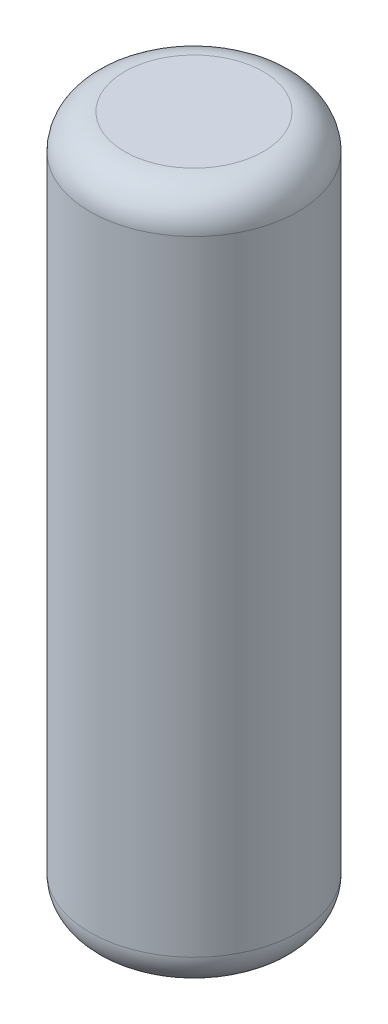
ISO-10303-21;
HEADER;
FILE_DESCRIPTION(('STEP AP214'),'2;1');
FILE_NAME('part.step','',(''),(''),'','','');
FILE_SCHEMA(('AUTOMOTIVE_DESIGN { 1 0 10303 214 1 1 1 1 }'));
ENDSEC;
DATA;
#1=APPLICATION_CONTEXT('core data for automotive mechanical design processes');
#2=APPLICATION_PROTOCOL_DEFINITION('international standard','automotive_design',2000,#1);
#3=PRODUCT_CONTEXT('',#1,'mechanical');
#4=PRODUCT('Part','Part','',(#3));
#5=PRODUCT_RELATED_PRODUCT_CATEGORY('part','',(#4));
#6=PRODUCT_DEFINITION_FORMATION('','',#4);
#7=PRODUCT_DEFINITION_CONTEXT('part definition',#1,'design');
#8=PRODUCT_DEFINITION('design','',#6,#7);
#9=PRODUCT_DEFINITION_SHAPE('','',#8);
#10=(LENGTH_UNIT() NAMED_UNIT(*) SI_UNIT(.MILLI.,.METRE.));
#11=(NAMED_UNIT(*) PLANE_ANGLE_UNIT() SI_UNIT($,.RADIAN.));
#12=(NAMED_UNIT(*) SI_UNIT($,.STERADIAN.) SOLID_ANGLE_UNIT());
#13=UNCERTAINTY_MEASURE_WITH_UNIT(LENGTH_MEASURE(1.E-05),#10,'distance_accuracy_value','');
#14=(GEOMETRIC_REPRESENTATION_CONTEXT(3) GLOBAL_UNCERTAINTY_ASSIGNED_CONTEXT((#13)) GLOBAL_UNIT_ASSIGNED_CONTEXT((#10,
#11,#12)) REPRESENTATION_CONTEXT('',''));
#15=CARTESIAN_POINT('',(0.,0.,0.));
#16=DIRECTION('',(0.,0.,1.));
#17=DIRECTION('',(1.,0.,0.));
#18=AXIS2_PLACEMENT_3D('',#15,#16,#17);
#19=CARTESIAN_POINT('',(0.,200.,0.));
#20=DIRECTION('',(0.,-1.,0.));
#21=DIRECTION('',(0.,0.,-1.));
#22=AXIS2_PLACEMENT_3D('',#19,#20,#21);
#23=CYLINDRICAL_SURFACE('',#22,30.);
#24=CARTESIAN_POINT('',(0.,10.,0.));
#25=DIRECTION('',(0.,1.,0.));
#26=DIRECTION('',(0.,0.,1.));
#27=AXIS2_PLACEMENT_3D('',#24,#25,#26);
#28=CIRCLE('',#27,30.);
#29=CARTESIAN_POINT('',(0.,10.,30.));
#30=VERTEX_POINT('',#29);
#31=EDGE_CURVE('E43',#30,#30,#28,.T.);
#32=ORIENTED_EDGE('',*,*,#31,.T.);
#33=EDGE_LOOP('',(#32));
#34=FACE_BOUND('',#33,.T.);
#35=CARTESIAN_POINT('',(0.,190.,0.));
#36=DIRECTION('',(0.,1.,0.));
#37=DIRECTION('',(0.,0.,1.));
#38=AXIS2_PLACEMENT_3D('',#35,#36,#37);
#39=CIRCLE('',#38,30.);
#40=CARTESIAN_POINT('',(0.,190.,30.));
#41=VERTEX_POINT('',#40);
#42=EDGE_CURVE('E47',#41,#41,#39,.F.);
#43=ORIENTED_EDGE('',*,*,#42,.T.);
#44=EDGE_LOOP('',(#43));
#45=FACE_BOUND('',#44,.T.);
#46=ADVANCED_FACE('F32',(#34,#45),#23,.T.);
#47=CARTESIAN_POINT('',(0.,200.,0.));
#48=DIRECTION('',(0.,1.,0.));
#49=DIRECTION('',(0.,0.,1.));
#50=AXIS2_PLACEMENT_3D('',#47,#48,#49);
#51=PLANE('',#50);
#52=CARTESIAN_POINT('',(0.,200.,0.));
#53=DIRECTION('',(0.,1.,0.));
#54=DIRECTION('',(0.,0.,1.));
#55=AXIS2_PLACEMENT_3D('',#52,#53,#54);
#56=CIRCLE('',#55,20.);
#57=CARTESIAN_POINT('',(0.,200.,20.));
#58=VERTEX_POINT('',#57);
#59=EDGE_CURVE('E10',#58,#58,#56,.T.);
#60=ORIENTED_EDGE('',*,*,#59,.T.);
#61=EDGE_LOOP('',(#60));
#62=FACE_BOUND('',#61,.T.);
#63=ADVANCED_FACE('F63',(#62),#51,.T.);
#64=CARTESIAN_POINT('',(0.,0.,0.));
#65=DIRECTION('',(0.,1.,0.));
#66=DIRECTION('',(0.,0.,1.));
#67=AXIS2_PLACEMENT_3D('',#64,#65,#66);
#68=PLANE('',#67);
#69=CARTESIAN_POINT('',(0.,0.,0.));
#70=DIRECTION('',(0.,1.,0.));
#71=DIRECTION('',(0.,0.,1.));
#72=AXIS2_PLACEMENT_3D('',#69,#70,#71);
#73=CIRCLE('',#72,20.);
#74=CARTESIAN_POINT('',(0.,0.,20.));
#75=VERTEX_POINT('',#74);
#76=EDGE_CURVE('E39',#75,#75,#73,.F.);
#77=ORIENTED_EDGE('',*,*,#76,.T.);
#78=EDGE_LOOP('',(#77));
#79=FACE_BOUND('',#78,.T.);
#80=ADVANCED_FACE('F60',(#79),#68,.F.);
#81=CARTESIAN_POINT('',(0.,10.,0.));
#82=DIRECTION('',(0.,1.,0.));
#83=DIRECTION('',(0.,0.,1.));
#84=AXIS2_PLACEMENT_3D('',#81,#82,#83);
#85=TOROIDAL_SURFACE('',#84,20.,10.);
#86=ORIENTED_EDGE('',*,*,#76,.F.);
#87=EDGE_LOOP('',(#86));
#88=FACE_BOUND('',#87,.T.);
#89=ORIENTED_EDGE('',*,*,#31,.F.);
#90=EDGE_LOOP('',(#89));
#91=FACE_BOUND('',#90,.T.);
#92=ADVANCED_FACE('F56',(#88,#91),#85,.T.);
#93=CARTESIAN_POINT('',(0.,190.,0.));
#94=DIRECTION('',(0.,1.,0.));
#95=DIRECTION('',(0.,0.,1.));
#96=AXIS2_PLACEMENT_3D('',#93,#94,#95);
#97=TOROIDAL_SURFACE('',#96,20.,10.);
#98=ORIENTED_EDGE('',*,*,#42,.F.);
#99=EDGE_LOOP('',(#98));
#100=FACE_BOUND('',#99,.T.);
#101=ORIENTED_EDGE('',*,*,#59,.F.);
#102=EDGE_LOOP('',(#101));
#103=FACE_BOUND('',#102,.T.);
#104=ADVANCED_FACE('F34',(#100,#103),#97,.T.);
#105=CLOSED_SHELL('',(#46,#63,#80,#92,#104));
#106=MANIFOLD_SOLID_BREP('B2',#105);
#107=ADVANCED_BREP_SHAPE_REPRESENTATION('',(#18,#106),#14);
#108=SHAPE_DEFINITION_REPRESENTATION(#9,#107);
ENDSEC;
END-ISO-10303-21;
